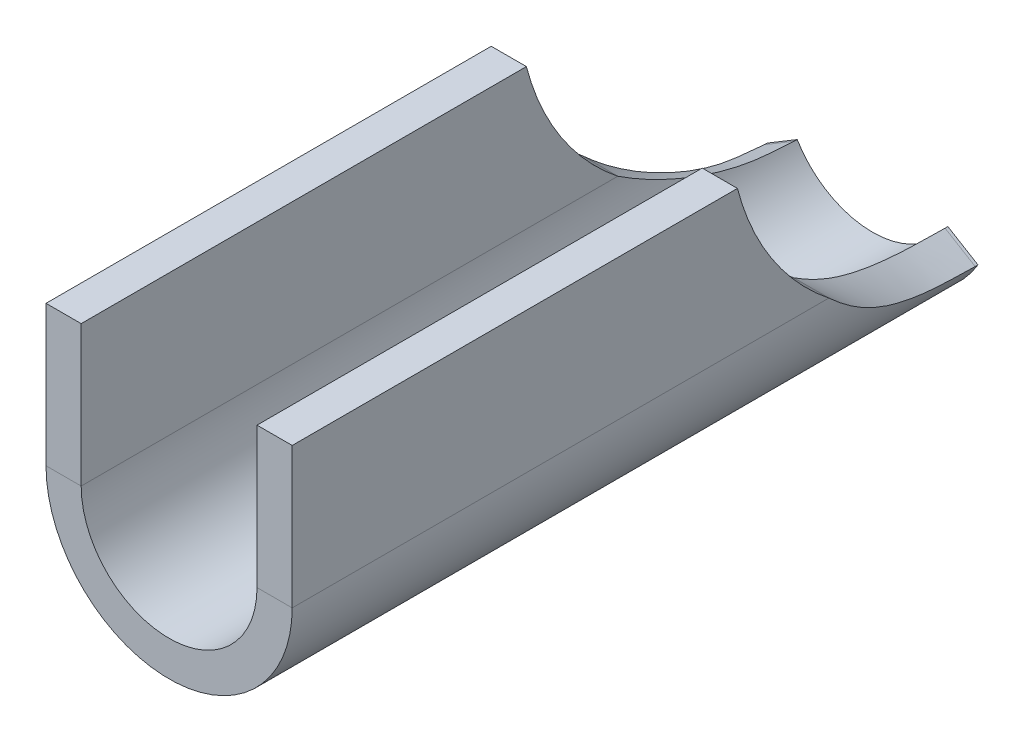
ISO-10303-21;
HEADER;
FILE_DESCRIPTION(('STEP AP214'),'2;1');
FILE_NAME('part.step','',(''),(''),'','','');
FILE_SCHEMA(('AUTOMOTIVE_DESIGN { 1 0 10303 214 1 1 1 1 }'));
ENDSEC;
DATA;
#1=APPLICATION_CONTEXT('core data for automotive mechanical design processes');
#2=APPLICATION_PROTOCOL_DEFINITION('international standard','automotive_design',2000,#1);
#3=PRODUCT_CONTEXT('',#1,'mechanical');
#4=PRODUCT('Part','Part','',(#3));
#5=PRODUCT_RELATED_PRODUCT_CATEGORY('part','',(#4));
#6=PRODUCT_DEFINITION_FORMATION('','',#4);
#7=PRODUCT_DEFINITION_CONTEXT('part definition',#1,'design');
#8=PRODUCT_DEFINITION('design','',#6,#7);
#9=PRODUCT_DEFINITION_SHAPE('','',#8);
#10=(LENGTH_UNIT() NAMED_UNIT(*) SI_UNIT(.MILLI.,.METRE.));
#11=(NAMED_UNIT(*) PLANE_ANGLE_UNIT() SI_UNIT($,.RADIAN.));
#12=(NAMED_UNIT(*) SI_UNIT($,.STERADIAN.) SOLID_ANGLE_UNIT());
#13=UNCERTAINTY_MEASURE_WITH_UNIT(LENGTH_MEASURE(1.E-05),#10,'distance_accuracy_value','');
#14=(GEOMETRIC_REPRESENTATION_CONTEXT(3) GLOBAL_UNCERTAINTY_ASSIGNED_CONTEXT((#13)) GLOBAL_UNIT_ASSIGNED_CONTEXT((#10,
#11,#12)) REPRESENTATION_CONTEXT('',''));
#15=CARTESIAN_POINT('',(0.,0.,0.));
#16=DIRECTION('',(0.,0.,1.));
#17=DIRECTION('',(1.,0.,0.));
#18=AXIS2_PLACEMENT_3D('',#15,#16,#17);
#19=CARTESIAN_POINT('',(-14.,1.04083408558608E-13,40.));
#20=DIRECTION('',(0.,1.,0.));
#21=DIRECTION('',(0.,0.,1.));
#22=AXIS2_PLACEMENT_3D('',#19,#20,#21);
#23=PLANE('',#22);
#24=DIRECTION('',(0.,0.,-1.));
#25=VECTOR('',#24,1.);
#26=CARTESIAN_POINT('',(-12.,1.04083408558608E-13,40.));
#27=LINE('',#26,#25);
#28=CARTESIAN_POINT('',(-12.,1.04083408558608E-13,40.));
#29=VERTEX_POINT('',#28);
#30=CARTESIAN_POINT('',(-12.,1.2490009027033E-13,14.6824583655185));
#31=VERTEX_POINT('',#30);
#32=EDGE_CURVE('E372',#29,#31,#27,.T.);
#33=ORIENTED_EDGE('',*,*,#32,.T.);
#34=DIRECTION('',(-1.,0.,0.));
#35=VECTOR('',#34,1.);
#36=CARTESIAN_POINT('',(-14.,1.2490009027033E-13,14.6824583655185));
#37=LINE('',#36,#35);
#38=CARTESIAN_POINT('',(-14.,1.2490009027033E-13,14.6824583655185));
#39=VERTEX_POINT('',#38);
#40=EDGE_CURVE('E360',#39,#31,#37,.F.);
#41=ORIENTED_EDGE('',*,*,#40,.F.);
#42=DIRECTION('',(0.,0.,-1.));
#43=VECTOR('',#42,1.);
#44=CARTESIAN_POINT('',(-14.,1.04083408558608E-13,40.));
#45=LINE('',#44,#43);
#46=CARTESIAN_POINT('',(-14.,1.04083408558608E-13,40.));
#47=VERTEX_POINT('',#46);
#48=EDGE_CURVE('E369',#47,#39,#45,.T.);
#49=ORIENTED_EDGE('',*,*,#48,.F.);
#50=DIRECTION('',(1.,0.,0.));
#51=VECTOR('',#50,1.);
#52=CARTESIAN_POINT('',(-14.,1.04083408558608E-13,40.));
#53=LINE('',#52,#51);
#54=EDGE_CURVE('E363',#47,#29,#53,.T.);
#55=ORIENTED_EDGE('',*,*,#54,.T.);
#56=EDGE_LOOP('',(#33,#41,#49,#55));
#57=FACE_BOUND('',#56,.T.);
#58=ADVANCED_FACE('F51',(#57),#23,.T.);
#59=CARTESIAN_POINT('',(-2.,-7.9999999999999,40.));
#60=DIRECTION('',(0.,0.,1.));
#61=DIRECTION('',(1.,0.,0.));
#62=AXIS2_PLACEMENT_3D('',#59,#60,#61);
#63=PLANE('',#62);
#64=DIRECTION('',(0.,1.,0.));
#65=VECTOR('',#64,1.);
#66=CARTESIAN_POINT('',(-14.,-7.9999999999999,40.));
#67=LINE('',#66,#65);
#68=CARTESIAN_POINT('',(-14.,-7.99999999999994,40.));
#69=VERTEX_POINT('',#68);
#70=EDGE_CURVE('E366',#69,#47,#67,.T.);
#71=ORIENTED_EDGE('',*,*,#70,.F.);
#72=DIRECTION('',(1.,0.,0.));
#73=VECTOR('',#72,1.);
#74=CARTESIAN_POINT('',(-14.,-7.9999999999999,40.));
#75=LINE('',#74,#73);
#76=CARTESIAN_POINT('',(-12.,-7.9999999999999,40.));
#77=VERTEX_POINT('',#76);
#78=EDGE_CURVE('E12',#69,#77,#75,.T.);
#79=ORIENTED_EDGE('',*,*,#78,.T.);
#80=DIRECTION('',(0.,1.,0.));
#81=VECTOR('',#80,1.);
#82=CARTESIAN_POINT('',(-12.,-7.9999999999999,40.));
#83=LINE('',#82,#81);
#84=EDGE_CURVE('E70',#77,#29,#83,.T.);
#85=ORIENTED_EDGE('',*,*,#84,.T.);
#86=ORIENTED_EDGE('',*,*,#54,.F.);
#87=EDGE_LOOP('',(#71,#79,#85,#86));
#88=FACE_BOUND('',#87,.T.);
#89=ADVANCED_FACE('F53',(#88),#63,.T.);
#90=CARTESIAN_POINT('',(-12.,-7.9999999999999,40.));
#91=DIRECTION('',(-1.,0.,0.));
#92=DIRECTION('',(0.,0.,1.));
#93=AXIS2_PLACEMENT_3D('',#90,#91,#92);
#94=PLANE('',#93);
#95=CARTESIAN_POINT('',(-12.,3.75000000000013,0.158770817240728));
#96=DIRECTION('',(-1.,0.,0.));
#97=DIRECTION('',(0.,-1.,0.));
#98=AXIS2_PLACEMENT_3D('',#95,#96,#97);
#99=CIRCLE('',#98,15.);
#100=CARTESIAN_POINT('',(-12.,-7.9999999999999,9.48279891672646));
#101=VERTEX_POINT('',#100);
#102=EDGE_CURVE('E77',#101,#31,#99,.T.);
#103=ORIENTED_EDGE('',*,*,#102,.T.);
#104=ORIENTED_EDGE('',*,*,#32,.F.);
#105=ORIENTED_EDGE('',*,*,#84,.F.);
#106=DIRECTION('',(0.,0.,-1.));
#107=VECTOR('',#106,1.);
#108=CARTESIAN_POINT('',(-12.,-7.9999999999999,40.));
#109=LINE('',#108,#107);
#110=EDGE_CURVE('E62',#77,#101,#109,.T.);
#111=ORIENTED_EDGE('',*,*,#110,.T.);
#112=EDGE_LOOP('',(#103,#104,#105,#111));
#113=FACE_BOUND('',#112,.T.);
#114=ADVANCED_FACE('F453',(#113),#94,.F.);
#115=CARTESIAN_POINT('',(-14.,-7.9999999999999,40.));
#116=DIRECTION('',(-1.,0.,0.));
#117=DIRECTION('',(0.,0.,1.));
#118=AXIS2_PLACEMENT_3D('',#115,#116,#117);
#119=PLANE('',#118);
#120=ORIENTED_EDGE('',*,*,#48,.T.);
#121=CARTESIAN_POINT('',(-14.,3.75000000000013,0.158770817240728));
#122=DIRECTION('',(-1.,0.,0.));
#123=DIRECTION('',(0.,-1.,0.));
#124=AXIS2_PLACEMENT_3D('',#121,#122,#123);
#125=CIRCLE('',#124,15.);
#126=CARTESIAN_POINT('',(-14.,-7.9999999999999,9.48279891672646));
#127=VERTEX_POINT('',#126);
#128=EDGE_CURVE('E376',#127,#39,#125,.T.);
#129=ORIENTED_EDGE('',*,*,#128,.F.);
#130=DIRECTION('',(0.,0.,-1.));
#131=VECTOR('',#130,1.);
#132=CARTESIAN_POINT('',(-14.,-7.9999999999999,40.));
#133=LINE('',#132,#131);
#134=EDGE_CURVE('E374',#69,#127,#133,.T.);
#135=ORIENTED_EDGE('',*,*,#134,.F.);
#136=ORIENTED_EDGE('',*,*,#70,.T.);
#137=EDGE_LOOP('',(#120,#129,#135,#136));
#138=FACE_BOUND('',#137,.T.);
#139=ADVANCED_FACE('F393',(#138),#119,.T.);
#140=CARTESIAN_POINT('',(-14.,3.75000000000013,0.158770817240728));
#141=DIRECTION('',(-1.,0.,0.));
#142=DIRECTION('',(0.,-1.,0.));
#143=AXIS2_PLACEMENT_3D('',#140,#141,#142);
#144=CYLINDRICAL_SURFACE('',#143,15.);
#145=ORIENTED_EDGE('',*,*,#128,.T.);
#146=ORIENTED_EDGE('',*,*,#40,.T.);
#147=ORIENTED_EDGE('',*,*,#102,.F.);
#148=CARTESIAN_POINT('',(-14.,-8.,9.48279891672646));
#149=CARTESIAN_POINT('',(-12.,-8.,9.48279891672646));
#150=B_SPLINE_CURVE_WITH_KNOTS('',1,(#148,#149),.UNSPECIFIED.,.F.,.F.,(2,2),(0.,1.),.UNSPECIFIED.);
#151=EDGE_CURVE('E381',#127,#101,#150,.T.);
#152=ORIENTED_EDGE('',*,*,#151,.F.);
#153=EDGE_LOOP('',(#145,#146,#147,#152));
#154=FACE_BOUND('',#153,.T.);
#155=ADVANCED_FACE('F323',(#154),#144,.F.);
#156=CARTESIAN_POINT('',(-2.,0.,40.));
#157=DIRECTION('',(0.,1.,0.));
#158=DIRECTION('',(0.,0.,1.));
#159=AXIS2_PLACEMENT_3D('',#156,#157,#158);
#160=PLANE('',#159);
#161=DIRECTION('',(0.,0.,-1.));
#162=VECTOR('',#161,1.);
#163=CARTESIAN_POINT('',(0.,0.,40.));
#164=LINE('',#163,#162);
#165=CARTESIAN_POINT('',(0.,0.,40.));
#166=VERTEX_POINT('',#165);
#167=CARTESIAN_POINT('',(0.,0.,14.6824583655185));
#168=VERTEX_POINT('',#167);
#169=EDGE_CURVE('E484',#166,#168,#164,.T.);
#170=ORIENTED_EDGE('',*,*,#169,.T.);
#171=DIRECTION('',(1.,0.,0.));
#172=VECTOR('',#171,1.);
#173=CARTESIAN_POINT('',(0.,0.,14.6824583655185));
#174=LINE('',#173,#172);
#175=CARTESIAN_POINT('',(-2.,0.,14.6824583655185));
#176=VERTEX_POINT('',#175);
#177=EDGE_CURVE('E481',#168,#176,#174,.F.);
#178=ORIENTED_EDGE('',*,*,#177,.T.);
#179=DIRECTION('',(0.,0.,-1.));
#180=VECTOR('',#179,1.);
#181=CARTESIAN_POINT('',(-2.,0.,40.));
#182=LINE('',#181,#180);
#183=CARTESIAN_POINT('',(-2.,0.,40.));
#184=VERTEX_POINT('',#183);
#185=EDGE_CURVE('E470',#184,#176,#182,.T.);
#186=ORIENTED_EDGE('',*,*,#185,.F.);
#187=DIRECTION('',(1.,0.,0.));
#188=VECTOR('',#187,1.);
#189=CARTESIAN_POINT('',(-2.,0.,40.));
#190=LINE('',#189,#188);
#191=EDGE_CURVE('E357',#184,#166,#190,.T.);
#192=ORIENTED_EDGE('',*,*,#191,.T.);
#193=EDGE_LOOP('',(#170,#178,#186,#192));
#194=FACE_BOUND('',#193,.T.);
#195=ADVANCED_FACE('F319',(#194),#160,.T.);
#196=CARTESIAN_POINT('',(0.,0.,40.));
#197=DIRECTION('',(1.,0.,0.));
#198=DIRECTION('',(0.,0.,-1.));
#199=AXIS2_PLACEMENT_3D('',#196,#197,#198);
#200=PLANE('',#199);
#201=DIRECTION('',(0.,0.,-1.));
#202=VECTOR('',#201,1.);
#203=CARTESIAN_POINT('',(0.,-8.,40.));
#204=LINE('',#203,#202);
#205=CARTESIAN_POINT('',(0.,-8.,40.));
#206=VERTEX_POINT('',#205);
#207=CARTESIAN_POINT('',(0.,-8.,9.48279891672649));
#208=VERTEX_POINT('',#207);
#209=EDGE_CURVE('E354',#206,#208,#204,.T.);
#210=ORIENTED_EDGE('',*,*,#209,.T.);
#211=CARTESIAN_POINT('',(0.,3.75,0.158770817240728));
#212=DIRECTION('',(1.,0.,0.));
#213=DIRECTION('',(0.,0.,-1.));
#214=AXIS2_PLACEMENT_3D('',#211,#212,#213);
#215=CIRCLE('',#214,15.);
#216=EDGE_CURVE('E342',#168,#208,#215,.T.);
#217=ORIENTED_EDGE('',*,*,#216,.F.);
#218=ORIENTED_EDGE('',*,*,#169,.F.);
#219=DIRECTION('',(0.,-1.,0.));
#220=VECTOR('',#219,1.);
#221=CARTESIAN_POINT('',(0.,0.,40.));
#222=LINE('',#221,#220);
#223=EDGE_CURVE('E351',#166,#206,#222,.T.);
#224=ORIENTED_EDGE('',*,*,#223,.T.);
#225=EDGE_LOOP('',(#210,#217,#218,#224));
#226=FACE_BOUND('',#225,.T.);
#227=ADVANCED_FACE('F322',(#226),#200,.T.);
#228=CARTESIAN_POINT('',(0.,3.75,0.158770817240728));
#229=DIRECTION('',(1.,0.,0.));
#230=DIRECTION('',(0.,0.,-1.));
#231=AXIS2_PLACEMENT_3D('',#228,#229,#230);
#232=CYLINDRICAL_SURFACE('',#231,15.);
#233=ORIENTED_EDGE('',*,*,#216,.T.);
#234=CARTESIAN_POINT('',(-2.,-8.,9.48279891672649));
#235=CARTESIAN_POINT('',(0.,-8.,9.48279891672649));
#236=B_SPLINE_CURVE_WITH_KNOTS('',1,(#234,#235),.UNSPECIFIED.,.F.,.F.,(2,2),(0.,1.),.UNSPECIFIED.);
#237=CARTESIAN_POINT('',(-2.,-8.,9.48279891672649));
#238=VERTEX_POINT('',#237);
#239=EDGE_CURVE('E350',#208,#238,#236,.F.);
#240=ORIENTED_EDGE('',*,*,#239,.T.);
#241=CARTESIAN_POINT('',(-2.,3.75,0.158770817240728));
#242=DIRECTION('',(1.,0.,0.));
#243=DIRECTION('',(0.,0.,-1.));
#244=AXIS2_PLACEMENT_3D('',#241,#242,#243);
#245=CIRCLE('',#244,15.);
#246=EDGE_CURVE('E475',#176,#238,#245,.T.);
#247=ORIENTED_EDGE('',*,*,#246,.F.);
#248=ORIENTED_EDGE('',*,*,#177,.F.);
#249=EDGE_LOOP('',(#233,#240,#247,#248));
#250=FACE_BOUND('',#249,.T.);
#251=ADVANCED_FACE('F327',(#250),#232,.F.);
#252=CARTESIAN_POINT('',(-2.,0.,40.));
#253=DIRECTION('',(1.,0.,0.));
#254=DIRECTION('',(0.,0.,-1.));
#255=AXIS2_PLACEMENT_3D('',#252,#253,#254);
#256=PLANE('',#255);
#257=ORIENTED_EDGE('',*,*,#246,.T.);
#258=DIRECTION('',(0.,0.,-1.));
#259=VECTOR('',#258,1.);
#260=CARTESIAN_POINT('',(-2.,-8.,40.));
#261=LINE('',#260,#259);
#262=CARTESIAN_POINT('',(-2.,-8.,40.));
#263=VERTEX_POINT('',#262);
#264=EDGE_CURVE('E153',#263,#238,#261,.T.);
#265=ORIENTED_EDGE('',*,*,#264,.F.);
#266=DIRECTION('',(0.,1.,0.));
#267=VECTOR('',#266,1.);
#268=CARTESIAN_POINT('',(-2.,0.,40.));
#269=LINE('',#268,#267);
#270=EDGE_CURVE('E469',#184,#263,#269,.F.);
#271=ORIENTED_EDGE('',*,*,#270,.F.);
#272=ORIENTED_EDGE('',*,*,#185,.T.);
#273=EDGE_LOOP('',(#257,#265,#271,#272));
#274=FACE_BOUND('',#273,.T.);
#275=ADVANCED_FACE('F332',(#274),#256,.F.);
#276=CARTESIAN_POINT('',(-7.,-8.,40.));
#277=DIRECTION('',(0.,0.,-1.));
#278=DIRECTION('',(-1.,0.,0.));
#279=AXIS2_PLACEMENT_3D('',#276,#277,#278);
#280=PLANE('',#279);
#281=ORIENTED_EDGE('',*,*,#270,.T.);
#282=DIRECTION('',(1.,0.,0.));
#283=VECTOR('',#282,1.);
#284=CARTESIAN_POINT('',(-2.,-8.,40.));
#285=LINE('',#284,#283);
#286=EDGE_CURVE('E309',#263,#206,#285,.T.);
#287=ORIENTED_EDGE('',*,*,#286,.T.);
#288=ORIENTED_EDGE('',*,*,#223,.F.);
#289=ORIENTED_EDGE('',*,*,#191,.F.);
#290=EDGE_LOOP('',(#281,#287,#288,#289));
#291=FACE_BOUND('',#290,.T.);
#292=ADVANCED_FACE('F446',(#291),#280,.F.);
#293=CARTESIAN_POINT('',(-7.,-8.,0.));
#294=DIRECTION('',(0.,0.,-1.));
#295=DIRECTION('',(-1.,0.,0.));
#296=AXIS2_PLACEMENT_3D('',#293,#294,#295);
#297=PLANE('',#296);
#298=DIRECTION('',(-0.85685059717934,-0.515564791382624,0.));
#299=VECTOR('',#298,1.);
#300=CARTESIAN_POINT('',(-12.9979541802554,-11.6089535396784,0.));
#301=LINE('',#300,#299);
#302=CARTESIAN_POINT('',(-11.2842529858967,-10.5778239569131,0.));
#303=VERTEX_POINT('',#302);
#304=CARTESIAN_POINT('',(-12.9979541802554,-11.6089535396784,0.));
#305=VERTEX_POINT('',#304);
#306=EDGE_CURVE('E143',#303,#305,#301,.T.);
#307=ORIENTED_EDGE('',*,*,#306,.F.);
#308=CARTESIAN_POINT('',(-7.,-8.,0.));
#309=DIRECTION('',(0.,0.,-1.));
#310=DIRECTION('',(-1.,0.,0.));
#311=AXIS2_PLACEMENT_3D('',#308,#309,#310);
#312=CIRCLE('',#311,5.);
#313=CARTESIAN_POINT('',(-2.71574701410335,-10.5778239569132,0.));
#314=VERTEX_POINT('',#313);
#315=EDGE_CURVE('E224',#303,#314,#312,.F.);
#316=ORIENTED_EDGE('',*,*,#315,.T.);
#317=DIRECTION('',(0.85685059717933,-0.51556479138264,0.));
#318=VECTOR('',#317,1.);
#319=CARTESIAN_POINT('',(-1.00204581974469,-11.6089535396785,0.));
#320=LINE('',#319,#318);
#321=CARTESIAN_POINT('',(-1.00204581974469,-11.6089535396785,0.));
#322=VERTEX_POINT('',#321);
#323=EDGE_CURVE('E154',#314,#322,#320,.T.);
#324=ORIENTED_EDGE('',*,*,#323,.T.);
#325=CARTESIAN_POINT('',(-7.,-8.,0.));
#326=DIRECTION('',(0.,0.,1.));
#327=DIRECTION('',(1.,0.,0.));
#328=AXIS2_PLACEMENT_3D('',#325,#326,#327);
#329=CIRCLE('',#328,7.);
#330=EDGE_CURVE('E157',#305,#322,#329,.T.);
#331=ORIENTED_EDGE('',*,*,#330,.F.);
#332=EDGE_LOOP('',(#307,#316,#324,#331));
#333=FACE_BOUND('',#332,.T.);
#334=ADVANCED_FACE('F158',(#333),#297,.T.);
#335=CARTESIAN_POINT('',(-1.00204581974469,-11.6089535396785,0.079385408620361));
#336=DIRECTION('',(0.51556479138264,0.85685059717933,0.));
#337=DIRECTION('',(0.,0.,1.));
#338=AXIS2_PLACEMENT_3D('',#335,#336,#337);
#339=PLANE('',#338);
#340=ORIENTED_EDGE('',*,*,#323,.F.);
#341=DIRECTION('',(0.,0.,-1.));
#342=VECTOR('',#341,1.);
#343=CARTESIAN_POINT('',(-2.71574701410335,-10.5778239569132,69.005445347089));
#344=LINE('',#343,#342);
#345=CARTESIAN_POINT('',(-2.71574701410335,-10.5778239569132,0.158770817240722));
#346=VERTEX_POINT('',#345);
#347=EDGE_CURVE('E215',#314,#346,#344,.F.);
#348=ORIENTED_EDGE('',*,*,#347,.T.);
#349=CARTESIAN_POINT('',(-1.00204581974469,-11.6089535396785,0.158770817240722));
#350=CARTESIAN_POINT('',(-2.71574701410335,-10.5778239569132,0.158770817240722));
#351=B_SPLINE_CURVE_WITH_KNOTS('',1,(#349,#350),.UNSPECIFIED.,.F.,.F.,(2,2),(0.,1.),.UNSPECIFIED.);
#352=CARTESIAN_POINT('',(-1.00204581974469,-11.6089535396785,0.158770817240722));
#353=VERTEX_POINT('',#352);
#354=EDGE_CURVE('E172',#346,#353,#351,.F.);
#355=ORIENTED_EDGE('',*,*,#354,.T.);
#356=DIRECTION('',(0.,0.,1.));
#357=VECTOR('',#356,1.);
#358=CARTESIAN_POINT('',(-1.00204581974469,-11.6089535396785,0.));
#359=LINE('',#358,#357);
#360=EDGE_CURVE('E162',#322,#353,#359,.T.);
#361=ORIENTED_EDGE('',*,*,#360,.F.);
#362=EDGE_LOOP('',(#340,#348,#355,#361));
#363=FACE_BOUND('',#362,.T.);
#364=ADVANCED_FACE('F249',(#363),#339,.T.);
#365=CARTESIAN_POINT('',(-1.00204581974469,-11.6089535396785,0.158770817240722));
#366=CARTESIAN_POINT('',(-0.985708337920428,-11.5818012180081,0.730464719622924));
#367=CARTESIAN_POINT('',(-0.96676653701687,-11.5499153382788,1.22956995000527));
#368=CARTESIAN_POINT('',(-0.934783317569084,-11.4947958205185,1.86934471989861));
#369=CARTESIAN_POINT('',(-0.923528224729409,-11.4752070363556,2.0644558010097));
#370=CARTESIAN_POINT('',(-0.905806344146855,-11.4439725580002,2.32990165939635));
#371=CARTESIAN_POINT('',(-0.899759246124836,-11.4332524884662,2.41384681831189));
#372=CARTESIAN_POINT('',(-0.890485994030063,-11.4167058092638,2.53295936586521));
#373=CARTESIAN_POINT('',(-0.88736114688623,-11.4111124855619,2.57152934991297));
#374=CARTESIAN_POINT('',(-0.882624159009066,-11.4026053774275,2.62768302827962));
#375=CARTESIAN_POINT('',(-0.88103687713397,-11.3997501541986,2.64611737145101));
#376=CARTESIAN_POINT('',(-0.878643643890197,-11.3954379782299,2.67334356178184));
#377=CARTESIAN_POINT('',(-0.877843847754514,-11.3939956960475,2.68234807115441));
#378=CARTESIAN_POINT('',(-0.876641090931798,-11.3918249298942,2.6957485041067));
#379=CARTESIAN_POINT('',(-0.876239661555454,-11.3911001173628,2.7001975932397));
#380=CARTESIAN_POINT('',(-0.875435784438738,-11.3896480434037,2.70906032780352));
#381=CARTESIAN_POINT('',(-0.875200673157735,-11.389223302487,2.71164846647976));
#382=CARTESIAN_POINT('',(-0.838131685100897,-11.3222078460287,3.11604143820889));
#383=CARTESIAN_POINT('',(-0.790386497966529,-11.2336531179235,3.5200978029581));
#384=CARTESIAN_POINT('',(-0.706286017442382,-11.0648193076725,4.13500958511348));
#385=CARTESIAN_POINT('',(-0.676196325035098,-11.0025324485708,4.34145138500387));
#386=CARTESIAN_POINT('',(-0.628753969588697,-10.8997668054558,4.65332089359734));
#387=CARTESIAN_POINT('',(-0.612556853075023,-10.8639554581353,4.75764519792146));
#388=CARTESIAN_POINT('',(-0.587798799773172,-10.8078627945744,4.91468335659714));
#389=CARTESIAN_POINT('',(-0.579469158527705,-10.7887692965838,4.96712135985396));
#390=CARTESIAN_POINT('',(-0.566874242143346,-10.7595299604403,5.04591629028653));
#391=CARTESIAN_POINT('',(-0.562659201020727,-10.7496836670942,5.07220425468862));
#392=CARTESIAN_POINT('',(-0.556313469537473,-10.7347638115489,5.11167068267859));
#393=CARTESIAN_POINT('',(-0.554194364502354,-10.7297654571408,5.12483190557304));
#394=CARTESIAN_POINT('',(-0.5499487594211,-10.7197185029924,5.15116584515758));
#395=CARTESIAN_POINT('',(-0.547651023298518,-10.7142620157704,5.1653979958134));
#396=CARTESIAN_POINT('',(-0.420329279300062,-10.4109792816483,5.95313492125406));
#397=CARTESIAN_POINT('',(-0.287398999484325,-10.0386312734864,6.69971736010421));
#398=CARTESIAN_POINT('',(-0.0771392811164387,-9.13535418627835,8.13481132386785));
#399=CARTESIAN_POINT('',(0.,-8.6038590688786,8.8229980608924));
#400=CARTESIAN_POINT('',(0.,-8.,9.48279891672649));
#401=CARTESIAN_POINT('',(-2.71574701410335,-10.5778239569132,0.158770817240722));
#402=CARTESIAN_POINT('',(-2.70407738407874,-10.5584294411849,0.730464726977965));
#403=CARTESIAN_POINT('',(-2.69054752644062,-10.5356538130563,1.22956995000527));
#404=CARTESIAN_POINT('',(-2.6677023696922,-10.4962827289418,1.86934471989861));
#405=CARTESIAN_POINT('',(-2.65966301766386,-10.482290740254,2.0644558010097));
#406=CARTESIAN_POINT('',(-2.64700453153347,-10.4599803985715,2.32990165939635));
#407=CARTESIAN_POINT('',(-2.64268517580345,-10.4523232060473,2.41384681831189));
#408=CARTESIAN_POINT('',(-2.63606142430719,-10.4405041494741,2.53295936586521));
#409=CARTESIAN_POINT('',(-2.63382939063302,-10.4365089182585,2.57152934991297));
#410=CARTESIAN_POINT('',(-2.63044582786362,-10.4304324124482,2.62768302827962));
#411=CARTESIAN_POINT('',(-2.62931205509569,-10.4283929672847,2.64611737145101));
#412=CARTESIAN_POINT('',(-2.62760260277871,-10.4253128415928,2.67334356178184));
#413=CARTESIAN_POINT('',(-2.62703131982465,-10.424282640034,2.68234807115441));
#414=CARTESIAN_POINT('',(-2.62617220780843,-10.4227320927816,2.6957485041067));
#415=CARTESIAN_POINT('',(-2.62588547253961,-10.4222143695448,2.7001975932397));
#416=CARTESIAN_POINT('',(-2.6253112745991,-10.4211771738598,2.70906032780352));
#417=CARTESIAN_POINT('',(-2.62514333796981,-10.4208737874907,2.71164846647976));
#418=CARTESIAN_POINT('',(-2.59866548935778,-10.3730056043062,3.11604143820889));
#419=CARTESIAN_POINT('',(-2.56456178426181,-10.3097522270882,3.5200978029581));
#420=CARTESIAN_POINT('',(-2.50449001245884,-10.1891566483375,4.13500958511348));
#421=CARTESIAN_POINT('',(-2.48299737502507,-10.1446660346934,4.34145138500387));
#422=CARTESIAN_POINT('',(-2.44910997827764,-10.071262003897,4.65332089359734));
#423=CARTESIAN_POINT('',(-2.4375406093393,-10.0456824700966,4.75764519792146));
#424=CARTESIAN_POINT('',(-2.41985628555227,-10.0056162818388,4.91468335659714));
#425=CARTESIAN_POINT('',(-2.4139065418055,-9.9919780689884,4.96712135985396));
#426=CARTESIAN_POINT('',(-2.40491017295953,-9.97109282888592,5.04591629028653));
#427=CARTESIAN_POINT('',(-2.40189942930052,-9.96405976221015,5.07220425468862));
#428=CARTESIAN_POINT('',(-2.39736676395534,-9.95340272253496,5.11167068267859));
#429=CARTESIAN_POINT('',(-2.39585311750168,-9.94983246938631,5.12483190557304));
#430=CARTESIAN_POINT('',(-2.39282054244364,-9.94265607356598,5.15116584515758));
#431=CARTESIAN_POINT('',(-2.39117930235608,-9.93875858269317,5.1653979958134));
#432=CARTESIAN_POINT('',(-2.30023519950004,-9.72212805832024,5.95313492125406));
#433=CARTESIAN_POINT('',(-2.20528499963166,-9.45616519534742,6.69971736010421));
#434=CARTESIAN_POINT('',(-2.05509948651174,-8.81096727591311,8.13481132386785));
#435=CARTESIAN_POINT('',(-2.,-8.43125504829953,8.82310951159608));
#436=CARTESIAN_POINT('',(-2.,-8.,9.48279891672649));
#437=B_SPLINE_SURFACE_WITH_KNOTS('',1,3,((#365,#366,#367,#368,#369,#370,#371,#372,#373,#374,
#375,#376,#377,#378,#379,#380,#381,#382,#383,#384,#385,#386,#387,#388,#389,#390,#391,#392,#393,
#394,#395,#396,#397,#398,#399,#400),(#401,#402,#403,#404,#405,#406,#407,#408,#409,#410,#411,
#412,#413,#414,#415,#416,#417,#418,#419,#420,#421,#422,#423,#424,#425,#426,#427,#428,#429,#430,
#431,#432,#433,#434,#435,#436)),.UNSPECIFIED.,.F.,.F.,.F.,(2,2),(4,2,2,2,2,2,2,2,2,2,2,2,2,2,2,
2,2,4),(0.,1.),(0.,0.125,0.1875,0.21875,0.234375,0.2421875,0.24609375,0.248046875,0.25,0.375,
0.4375,0.46875,0.484375,0.4921875,0.49609375,0.5,0.75,1.),.UNSPECIFIED.);
#438=CARTESIAN_POINT('',(-2.71574701410335,-10.5778239569132,0.158770817240722));
#439=CARTESIAN_POINT('',(-2.70407738407874,-10.5584294411849,0.730464726977965));
#440=CARTESIAN_POINT('',(-2.69054752644062,-10.5356538130563,1.22956995000527));
#441=CARTESIAN_POINT('',(-2.6677023696922,-10.4962827289418,1.86934471989861));
#442=CARTESIAN_POINT('',(-2.65966301766386,-10.482290740254,2.0644558010097));
#443=CARTESIAN_POINT('',(-2.64700453153347,-10.4599803985715,2.32990165939635));
#444=CARTESIAN_POINT('',(-2.64268517580345,-10.4523232060473,2.41384681831189));
#445=CARTESIAN_POINT('',(-2.63606142430719,-10.4405041494741,2.53295936586521));
#446=CARTESIAN_POINT('',(-2.63382939063302,-10.4365089182585,2.57152934991297));
#447=CARTESIAN_POINT('',(-2.63044582786362,-10.4304324124482,2.62768302827962));
#448=CARTESIAN_POINT('',(-2.62931205509569,-10.4283929672847,2.64611737145101));
#449=CARTESIAN_POINT('',(-2.62760260277871,-10.4253128415928,2.67334356178184));
#450=CARTESIAN_POINT('',(-2.62703131982465,-10.424282640034,2.68234807115441));
#451=CARTESIAN_POINT('',(-2.62617220780843,-10.4227320927816,2.6957485041067));
#452=CARTESIAN_POINT('',(-2.62588547253961,-10.4222143695448,2.7001975932397));
#453=CARTESIAN_POINT('',(-2.6253112745991,-10.4211771738598,2.70906032780352));
#454=CARTESIAN_POINT('',(-2.62514333796981,-10.4208737874907,2.71164846647976));
#455=CARTESIAN_POINT('',(-2.59866548935778,-10.3730056043062,3.11604143820889));
#456=CARTESIAN_POINT('',(-2.56456178426181,-10.3097522270882,3.5200978029581));
#457=CARTESIAN_POINT('',(-2.50449001245884,-10.1891566483375,4.13500958511348));
#458=CARTESIAN_POINT('',(-2.48299737502507,-10.1446660346934,4.34145138500387));
#459=CARTESIAN_POINT('',(-2.44910997827764,-10.071262003897,4.65332089359734));
#460=CARTESIAN_POINT('',(-2.4375406093393,-10.0456824700966,4.75764519792146));
#461=CARTESIAN_POINT('',(-2.41985628555227,-10.0056162818388,4.91468335659714));
#462=CARTESIAN_POINT('',(-2.4139065418055,-9.9919780689884,4.96712135985396));
#463=CARTESIAN_POINT('',(-2.40491017295953,-9.97109282888592,5.04591629028653));
#464=CARTESIAN_POINT('',(-2.40189942930052,-9.96405976221015,5.07220425468862));
#465=CARTESIAN_POINT('',(-2.39736676395534,-9.95340272253496,5.11167068267859));
#466=CARTESIAN_POINT('',(-2.39585311750168,-9.94983246938631,5.12483190557304));
#467=CARTESIAN_POINT('',(-2.39282054244364,-9.94265607356598,5.15116584515758));
#468=CARTESIAN_POINT('',(-2.39117930235608,-9.93875858269317,5.1653979958134));
#469=CARTESIAN_POINT('',(-2.30023519950004,-9.72212805832024,5.95313492125406));
#470=CARTESIAN_POINT('',(-2.20528499963166,-9.45616519534742,6.69971736010421));
#471=CARTESIAN_POINT('',(-2.05509948651174,-8.81096727591311,8.13481132386785));
#472=CARTESIAN_POINT('',(-2.,-8.43125504829953,8.82310951159608));
#473=CARTESIAN_POINT('',(-2.,-8.,9.48279891672649));
#474=B_SPLINE_CURVE_WITH_KNOTS('',3,(#438,#439,#440,#441,#442,#443,#444,#445,#446,#447,#448,
#449,#450,#451,#452,#453,#454,#455,#456,#457,#458,#459,#460,#461,#462,#463,#464,#465,#466,#467,
#468,#469,#470,#471,#472,#473),.UNSPECIFIED.,.F.,.F.,(4,2,2,2,2,2,2,2,2,2,2,2,2,2,2,2,2,4),(0.,
0.125,0.1875,0.21875,0.234375,0.2421875,0.24609375,0.248046875,0.25,0.375,0.4375,0.46875,
0.484375,0.4921875,0.49609375,0.5,0.75,1.),.UNSPECIFIED.);
#475=EDGE_CURVE('E223',#346,#238,#474,.T.);
#476=CARTESIAN_POINT('',(0.,-8.,9.48279891672649));
#477=CARTESIAN_POINT('',(0.,-8.6038590688786,8.8229980608924));
#478=CARTESIAN_POINT('',(-0.0771392811164387,-9.13535418627835,8.13481132386785));
#479=CARTESIAN_POINT('',(-0.287398999484325,-10.0386312734864,6.69971736010421));
#480=CARTESIAN_POINT('',(-0.420329279300062,-10.4109792816483,5.95313492125406));
#481=CARTESIAN_POINT('',(-0.547651023298518,-10.7142620157704,5.1653979958134));
#482=CARTESIAN_POINT('',(-0.5499487594211,-10.7197185029924,5.15116584515758));
#483=CARTESIAN_POINT('',(-0.554194364502354,-10.7297654571408,5.12483190557304));
#484=CARTESIAN_POINT('',(-0.556313469537473,-10.7347638115489,5.11167068267859));
#485=CARTESIAN_POINT('',(-0.562659201020727,-10.7496836670942,5.07220425468862));
#486=CARTESIAN_POINT('',(-0.566874242143346,-10.7595299604403,5.04591629028653));
#487=CARTESIAN_POINT('',(-0.579469158527705,-10.7887692965838,4.96712135985396));
#488=CARTESIAN_POINT('',(-0.587798799773172,-10.8078627945744,4.91468335659714));
#489=CARTESIAN_POINT('',(-0.612556853075023,-10.8639554581353,4.75764519792146));
#490=CARTESIAN_POINT('',(-0.628753969588697,-10.8997668054558,4.65332089359734));
#491=CARTESIAN_POINT('',(-0.676196325035098,-11.0025324485708,4.34145138500387));
#492=CARTESIAN_POINT('',(-0.706286017442382,-11.0648193076725,4.13500958511348));
#493=CARTESIAN_POINT('',(-0.790386497966529,-11.2336531179235,3.5200978029581));
#494=CARTESIAN_POINT('',(-0.838131685100897,-11.3222078460287,3.11604143820889));
#495=CARTESIAN_POINT('',(-0.875200673157735,-11.389223302487,2.71164846647976));
#496=CARTESIAN_POINT('',(-0.875435784438738,-11.3896480434037,2.70906032780352));
#497=CARTESIAN_POINT('',(-0.876239661555454,-11.3911001173628,2.7001975932397));
#498=CARTESIAN_POINT('',(-0.876641090931798,-11.3918249298942,2.6957485041067));
#499=CARTESIAN_POINT('',(-0.877843847754514,-11.3939956960475,2.68234807115441));
#500=CARTESIAN_POINT('',(-0.878643643890197,-11.3954379782299,2.67334356178184));
#501=CARTESIAN_POINT('',(-0.88103687713397,-11.3997501541986,2.64611737145101));
#502=CARTESIAN_POINT('',(-0.882624159009066,-11.4026053774275,2.62768302827962));
#503=CARTESIAN_POINT('',(-0.88736114688623,-11.4111124855619,2.57152934991297));
#504=CARTESIAN_POINT('',(-0.890485994030063,-11.4167058092638,2.53295936586521));
#505=CARTESIAN_POINT('',(-0.899759246124836,-11.4332524884662,2.41384681831189));
#506=CARTESIAN_POINT('',(-0.905806344146855,-11.4439725580002,2.32990165939635));
#507=CARTESIAN_POINT('',(-0.923528224729409,-11.4752070363556,2.0644558010097));
#508=CARTESIAN_POINT('',(-0.934783317569084,-11.4947958205185,1.86934471989861));
#509=CARTESIAN_POINT('',(-0.96676653701687,-11.5499153382788,1.22956995000527));
#510=CARTESIAN_POINT('',(-0.985708337920428,-11.5818012180081,0.730464719622924));
#511=CARTESIAN_POINT('',(-1.00204581974469,-11.6089535396785,0.158770817240722));
#512=B_SPLINE_CURVE_WITH_KNOTS('',3,(#476,#477,#478,#479,#480,#481,#482,#483,#484,#485,#486,
#487,#488,#489,#490,#491,#492,#493,#494,#495,#496,#497,#498,#499,#500,#501,#502,#503,#504,#505,
#506,#507,#508,#509,#510,#511),.UNSPECIFIED.,.F.,.F.,(4,2,2,2,2,2,2,2,2,2,2,2,2,2,2,2,2,4),(0.,
0.25,0.5,0.50390625,0.5078125,0.515625,0.53125,0.5625,0.625,0.75,0.751953125,0.75390625,
0.7578125,0.765625,0.78125,0.8125,0.875,1.),.UNSPECIFIED.);
#513=EDGE_CURVE('E231',#353,#208,#512,.F.);
#514=ORIENTED_EDGE('',*,*,#354,.F.);
#515=ORIENTED_EDGE('',*,*,#475,.T.);
#516=ORIENTED_EDGE('',*,*,#239,.F.);
#517=ORIENTED_EDGE('',*,*,#513,.F.);
#518=EDGE_LOOP('',(#514,#515,#516,#517));
#519=FACE_BOUND('',#518,.T.);
#520=ADVANCED_FACE('F237',(#519),#437,.T.);
#521=CARTESIAN_POINT('',(-7.,-8.,40.));
#522=DIRECTION('',(0.,0.,1.));
#523=DIRECTION('',(1.,0.,0.));
#524=AXIS2_PLACEMENT_3D('',#521,#522,#523);
#525=PLANE('',#524);
#526=ORIENTED_EDGE('',*,*,#286,.F.);
#527=CARTESIAN_POINT('',(-7.,-8.,40.));
#528=DIRECTION('',(0.,0.,-1.));
#529=DIRECTION('',(-1.,0.,0.));
#530=AXIS2_PLACEMENT_3D('',#527,#528,#529);
#531=CIRCLE('',#530,5.);
#532=EDGE_CURVE('E433',#263,#77,#531,.T.);
#533=ORIENTED_EDGE('',*,*,#532,.T.);
#534=ORIENTED_EDGE('',*,*,#78,.F.);
#535=CARTESIAN_POINT('',(-7.,-8.,40.));
#536=DIRECTION('',(0.,0.,-1.));
#537=DIRECTION('',(-1.,0.,0.));
#538=AXIS2_PLACEMENT_3D('',#535,#536,#537);
#539=CIRCLE('',#538,7.);
#540=EDGE_CURVE('E174',#206,#69,#539,.T.);
#541=ORIENTED_EDGE('',*,*,#540,.F.);
#542=EDGE_LOOP('',(#526,#533,#534,#541));
#543=FACE_BOUND('',#542,.T.);
#544=ADVANCED_FACE('F248',(#543),#525,.T.);
#545=CARTESIAN_POINT('',(-14.,-8.,9.48279891672646));
#546=CARTESIAN_POINT('',(-14.,-8.60385906887387,8.82299806089753));
#547=CARTESIAN_POINT('',(-13.9228607188847,-9.13535418627133,8.13481132387555));
#548=CARTESIAN_POINT('',(-13.7651659301095,-9.8128120016775,7.05849085105282));
#549=CARTESIAN_POINT('',(-13.7054207125888,-10.0189354629789,6.69245849586919));
#550=CARTESIAN_POINT('',(-13.6123544930597,-10.2992302825588,6.13252166672965));
#551=CARTESIAN_POINT('',(-13.5807433470151,-10.3878576731006,5.94406134095578));
#552=CARTESIAN_POINT('',(-13.5332286273556,-10.5137492952298,5.65864877820397));
#553=CARTESIAN_POINT('',(-13.5173731519157,-10.5545386606538,5.56305757827152));
#554=CARTESIAN_POINT('',(-13.4936542206526,-10.6139835510427,5.4189902598501));
#555=CARTESIAN_POINT('',(-13.4857585681691,-10.6335086723634,5.3708544006225));
#556=CARTESIAN_POINT('',(-13.4739418443385,-10.6623645560143,5.29848048215041));
#557=CARTESIAN_POINT('',(-13.470007392093,-10.6719112183789,5.27432748772126));
#558=CARTESIAN_POINT('',(-13.4641137122995,-10.6861236415364,5.23805546366988));
#559=CARTESIAN_POINT('',(-13.4621504852496,-10.6908431875715,5.22595770025148));
#560=CARTESIAN_POINT('',(-13.4582269135121,-10.7002464864709,5.20174799594544));
#561=CARTESIAN_POINT('',(-13.4564378049007,-10.7045223518555,5.19069548902308));
#562=CARTESIAN_POINT('',(-13.3861467443584,-10.8719569498756,4.75580619063463));
#563=CARTESIAN_POINT('',(-13.3217474760679,-11.0085413709174,4.33998017918237));
#564=CARTESIAN_POINT('',(-13.2376469955439,-11.1773751811685,3.72506839702699));
#565=CARTESIAN_POINT('',(-13.2116693686891,-11.227645050312,3.52156900881237));
#566=CARTESIAN_POINT('',(-13.176408971742,-11.2943291339761,3.21852673524619));
#567=CARTESIAN_POINT('',(-13.1652716049971,-11.3151033079956,3.11788044551674));
#568=CARTESIAN_POINT('',(-13.1495536037286,-11.3441159446684,2.96746271311152));
#569=CARTESIAN_POINT('',(-13.1444788499802,-11.3534286863414,2.91741541934127));
#570=CARTESIAN_POINT('',(-13.1371207321635,-11.3668642966277,2.84248240423313));
#571=CARTESIAN_POINT('',(-13.1347103558712,-11.3712539140645,2.81752772012163));
#572=CARTESIAN_POINT('',(-13.1311591266112,-11.3777054030887,2.78013017534117));
#573=CARTESIAN_POINT('',(-13.1299861056935,-11.3798337430924,2.76767007397882));
#574=CARTESIAN_POINT('',(-13.1282427594197,-11.3829930724663,2.748988542282));
#575=CARTESIAN_POINT('',(-13.1276643414898,-11.3840406521428,2.74276280177417));
#576=CARTESIAN_POINT('',(-13.1265129173251,-11.3861247601307,2.73031419420742));
#577=CARTESIAN_POINT('',(-13.1257725746309,-11.387463808953,2.72226582039366));
#578=CARTESIAN_POINT('',(-13.0737912939001,-11.4814385689361,2.15519167862265));
#579=CARTESIAN_POINT('',(-13.0306291353598,-11.5546489105377,1.30215832302292));
#580=CARTESIAN_POINT('',(-12.9979541802554,-11.6089535396784,0.158770817240722));
#581=CARTESIAN_POINT('',(-12.,-8.,9.48279891672646));
#582=CARTESIAN_POINT('',(-12.,-8.43125504829615,8.82310951160122));
#583=CARTESIAN_POINT('',(-11.9449005134891,-8.81096727590809,8.13481132387555));
#584=CARTESIAN_POINT('',(-11.8322613786496,-9.29486571548392,7.05849085105282));
#585=CARTESIAN_POINT('',(-11.7895862232777,-9.44209675927066,6.69245849586919));
#586=CARTESIAN_POINT('',(-11.7231103521855,-9.64230734468487,6.13252166672965));
#587=CARTESIAN_POINT('',(-11.7005309621537,-9.70561262364331,5.94406134095578));
#588=CARTESIAN_POINT('',(-11.6665918766826,-9.79553521087842,5.65864877820397));
#589=CARTESIAN_POINT('',(-11.6552665370826,-9.82467047189556,5.56305757827152));
#590=CARTESIAN_POINT('',(-11.6383244433233,-9.86713110788762,5.4189902598501));
#591=CARTESIAN_POINT('',(-11.6326846915494,-9.88107762311669,5.3708544006225));
#592=CARTESIAN_POINT('',(-11.6242441745275,-9.90168896858163,5.29848048215041));
#593=CARTESIAN_POINT('',(-11.621433851495,-9.90850801312781,5.27432748772126));
#594=CARTESIAN_POINT('',(-11.6172240802139,-9.91865974395456,5.23805546366988));
#595=CARTESIAN_POINT('',(-11.6158217751783,-9.92203084826539,5.22595770025148));
#596=CARTESIAN_POINT('',(-11.6130192239373,-9.92874749033639,5.20174799594544));
#597=CARTESIAN_POINT('',(-11.6117412892148,-9.93180167989678,5.19069548902308));
#598=CARTESIAN_POINT('',(-11.5615333888275,-10.0513978213397,4.75580619063463));
#599=CARTESIAN_POINT('',(-11.5155339114771,-10.1489581220839,4.33998017918237));
#600=CARTESIAN_POINT('',(-11.4554621396742,-10.2695537008346,3.72506839702699));
#601=CARTESIAN_POINT('',(-11.4369066919208,-10.3054607502229,3.52156900881237));
#602=CARTESIAN_POINT('',(-11.4117206941014,-10.3530922385544,3.21852673524619));
#603=CARTESIAN_POINT('',(-11.4037654321408,-10.3679309342825,3.11788044551674));
#604=CARTESIAN_POINT('',(-11.3925382883776,-10.3886542461917,2.96746271311152));
#605=CARTESIAN_POINT('',(-11.3889134642716,-10.3953062045296,2.91741541934127));
#606=CARTESIAN_POINT('',(-11.3836576658311,-10.4049030690198,2.84248240423313));
#607=CARTESIAN_POINT('',(-11.3819359684795,-10.408038510046,2.81752772012163));
#608=CARTESIAN_POINT('',(-11.3793993761509,-10.4126467164919,2.78013017534117));
#609=CARTESIAN_POINT('',(-11.3785615040668,-10.4141669593517,2.76767007397882));
#610=CARTESIAN_POINT('',(-11.3773162567284,-10.4164236231902,2.748988542282));
#611=CARTESIAN_POINT('',(-11.3769031010641,-10.4171718943877,2.74276280177417));
#612=CARTESIAN_POINT('',(-11.3760806552322,-10.4186605429505,2.73031419420742));
#613=CARTESIAN_POINT('',(-11.375551839022,-10.419617006395,2.72226582039366));
#614=CARTESIAN_POINT('',(-11.3384223527858,-10.4867418349544,2.15519167862265));
#615=CARTESIAN_POINT('',(-11.3075922428276,-10.539034930639,1.30215848395039));
#616=CARTESIAN_POINT('',(-11.2842529858967,-10.5778239569131,0.158770817240722));
#617=B_SPLINE_SURFACE_WITH_KNOTS('',1,3,((#545,#546,#547,#548,#549,#550,#551,#552,#553,#554,
#555,#556,#557,#558,#559,#560,#561,#562,#563,#564,#565,#566,#567,#568,#569,#570,#571,#572,#573,
#574,#575,#576,#577,#578,#579,#580),(#581,#582,#583,#584,#585,#586,#587,#588,#589,#590,#591,
#592,#593,#594,#595,#596,#597,#598,#599,#600,#601,#602,#603,#604,#605,#606,#607,#608,#609,#610,
#611,#612,#613,#614,#615,#616)),.UNSPECIFIED.,.F.,.F.,.F.,(2,2),(4,2,2,2,2,2,2,2,2,2,2,2,2,2,2,
2,2,4),(0.,1.),(0.,0.25,0.375,0.4375,0.46875,0.484375,0.4921875,0.49609375,0.5,0.625,0.6875,
0.71875,0.734375,0.7421875,0.74609375,0.748046875,0.75,1.),.UNSPECIFIED.);
#618=CARTESIAN_POINT('',(-12.,-8.,9.48279891672646));
#619=CARTESIAN_POINT('',(-12.,-8.43125504829615,8.82310951160122));
#620=CARTESIAN_POINT('',(-11.9449005134891,-8.81096727590809,8.13481132387555));
#621=CARTESIAN_POINT('',(-11.8322613786496,-9.29486571548392,7.05849085105282));
#622=CARTESIAN_POINT('',(-11.7895862232777,-9.44209675927066,6.69245849586919));
#623=CARTESIAN_POINT('',(-11.7231103521855,-9.64230734468487,6.13252166672965));
#624=CARTESIAN_POINT('',(-11.7005309621537,-9.70561262364331,5.94406134095578));
#625=CARTESIAN_POINT('',(-11.6665918766826,-9.79553521087842,5.65864877820397));
#626=CARTESIAN_POINT('',(-11.6552665370826,-9.82467047189556,5.56305757827152));
#627=CARTESIAN_POINT('',(-11.6383244433233,-9.86713110788762,5.4189902598501));
#628=CARTESIAN_POINT('',(-11.6326846915494,-9.88107762311669,5.3708544006225));
#629=CARTESIAN_POINT('',(-11.6242441745275,-9.90168896858163,5.29848048215041));
#630=CARTESIAN_POINT('',(-11.621433851495,-9.90850801312781,5.27432748772126));
#631=CARTESIAN_POINT('',(-11.6172240802139,-9.91865974395456,5.23805546366988));
#632=CARTESIAN_POINT('',(-11.6158217751783,-9.92203084826539,5.22595770025148));
#633=CARTESIAN_POINT('',(-11.6130192239373,-9.92874749033639,5.20174799594544));
#634=CARTESIAN_POINT('',(-11.6117412892148,-9.93180167989678,5.19069548902308));
#635=CARTESIAN_POINT('',(-11.5615333888275,-10.0513978213397,4.75580619063463));
#636=CARTESIAN_POINT('',(-11.5155339114771,-10.1489581220839,4.33998017918237));
#637=CARTESIAN_POINT('',(-11.4554621396742,-10.2695537008346,3.72506839702699));
#638=CARTESIAN_POINT('',(-11.4369066919208,-10.3054607502229,3.52156900881237));
#639=CARTESIAN_POINT('',(-11.4117206941014,-10.3530922385544,3.21852673524619));
#640=CARTESIAN_POINT('',(-11.4037654321408,-10.3679309342825,3.11788044551674));
#641=CARTESIAN_POINT('',(-11.3925382883776,-10.3886542461917,2.96746271311152));
#642=CARTESIAN_POINT('',(-11.3889134642716,-10.3953062045296,2.91741541934127));
#643=CARTESIAN_POINT('',(-11.3836576658311,-10.4049030690198,2.84248240423313));
#644=CARTESIAN_POINT('',(-11.3819359684795,-10.408038510046,2.81752772012163));
#645=CARTESIAN_POINT('',(-11.3793993761509,-10.4126467164919,2.78013017534117));
#646=CARTESIAN_POINT('',(-11.3785615040668,-10.4141669593517,2.76767007397882));
#647=CARTESIAN_POINT('',(-11.3773162567284,-10.4164236231902,2.748988542282));
#648=CARTESIAN_POINT('',(-11.3769031010641,-10.4171718943877,2.74276280177417));
#649=CARTESIAN_POINT('',(-11.3760806552322,-10.4186605429505,2.73031419420742));
#650=CARTESIAN_POINT('',(-11.375551839022,-10.419617006395,2.72226582039366));
#651=CARTESIAN_POINT('',(-11.3384223527858,-10.4867418349544,2.15519167862265));
#652=CARTESIAN_POINT('',(-11.3075922428276,-10.539034930639,1.30215848395039));
#653=CARTESIAN_POINT('',(-11.2842529858967,-10.5778239569131,0.158770817240722));
#654=B_SPLINE_CURVE_WITH_KNOTS('',3,(#618,#619,#620,#621,#622,#623,#624,#625,#626,#627,#628,
#629,#630,#631,#632,#633,#634,#635,#636,#637,#638,#639,#640,#641,#642,#643,#644,#645,#646,#647,
#648,#649,#650,#651,#652,#653),.UNSPECIFIED.,.F.,.F.,(4,2,2,2,2,2,2,2,2,2,2,2,2,2,2,2,2,4),(0.,
0.25,0.375,0.4375,0.46875,0.484375,0.4921875,0.49609375,0.5,0.625,0.6875,0.71875,0.734375,
0.7421875,0.74609375,0.748046875,0.75,1.),.UNSPECIFIED.);
#655=CARTESIAN_POINT('',(-11.2842529858967,-10.5778239569131,0.158770817240722));
#656=VERTEX_POINT('',#655);
#657=EDGE_CURVE('E185',#101,#656,#654,.T.);
#658=CARTESIAN_POINT('',(-11.2842529858967,-10.5778239569131,0.158770817240722));
#659=CARTESIAN_POINT('',(-12.9979541802554,-11.6089535396784,0.158770817240722));
#660=B_SPLINE_CURVE_WITH_KNOTS('',1,(#658,#659),.UNSPECIFIED.,.F.,.F.,(2,2),(0.,1.),.UNSPECIFIED.);
#661=CARTESIAN_POINT('',(-12.9979541802554,-11.6089535396784,0.158770817240722));
#662=VERTEX_POINT('',#661);
#663=EDGE_CURVE('E170',#656,#662,#660,.T.);
#664=CARTESIAN_POINT('',(-12.9979541802554,-11.6089535396784,0.158770817240722));
#665=CARTESIAN_POINT('',(-13.0306291353598,-11.5546489105377,1.30215832302292));
#666=CARTESIAN_POINT('',(-13.0737912939001,-11.4814385689361,2.15519167862265));
#667=CARTESIAN_POINT('',(-13.1257725746309,-11.387463808953,2.72226582039366));
#668=CARTESIAN_POINT('',(-13.1265129173251,-11.3861247601307,2.73031419420742));
#669=CARTESIAN_POINT('',(-13.1276643414898,-11.3840406521428,2.74276280177417));
#670=CARTESIAN_POINT('',(-13.1282427594197,-11.3829930724663,2.748988542282));
#671=CARTESIAN_POINT('',(-13.1299861056935,-11.3798337430924,2.76767007397882));
#672=CARTESIAN_POINT('',(-13.1311591266112,-11.3777054030887,2.78013017534117));
#673=CARTESIAN_POINT('',(-13.1347103558712,-11.3712539140645,2.81752772012163));
#674=CARTESIAN_POINT('',(-13.1371207321635,-11.3668642966277,2.84248240423313));
#675=CARTESIAN_POINT('',(-13.1444788499802,-11.3534286863414,2.91741541934127));
#676=CARTESIAN_POINT('',(-13.1495536037286,-11.3441159446684,2.96746271311152));
#677=CARTESIAN_POINT('',(-13.1652716049971,-11.3151033079956,3.11788044551674));
#678=CARTESIAN_POINT('',(-13.176408971742,-11.2943291339761,3.21852673524619));
#679=CARTESIAN_POINT('',(-13.2116693686891,-11.227645050312,3.52156900881237));
#680=CARTESIAN_POINT('',(-13.2376469955439,-11.1773751811685,3.72506839702699));
#681=CARTESIAN_POINT('',(-13.3217474760679,-11.0085413709174,4.33998017918237));
#682=CARTESIAN_POINT('',(-13.3861467443584,-10.8719569498756,4.75580619063463));
#683=CARTESIAN_POINT('',(-13.4564378049007,-10.7045223518555,5.19069548902308));
#684=CARTESIAN_POINT('',(-13.4582269135121,-10.7002464864709,5.20174799594544));
#685=CARTESIAN_POINT('',(-13.4621504852496,-10.6908431875715,5.22595770025148));
#686=CARTESIAN_POINT('',(-13.4641137122995,-10.6861236415364,5.23805546366988));
#687=CARTESIAN_POINT('',(-13.470007392093,-10.6719112183789,5.27432748772126));
#688=CARTESIAN_POINT('',(-13.4739418443385,-10.6623645560143,5.29848048215041));
#689=CARTESIAN_POINT('',(-13.4857585681691,-10.6335086723634,5.3708544006225));
#690=CARTESIAN_POINT('',(-13.4936542206526,-10.6139835510427,5.4189902598501));
#691=CARTESIAN_POINT('',(-13.5173731519157,-10.5545386606538,5.56305757827152));
#692=CARTESIAN_POINT('',(-13.5332286273556,-10.5137492952298,5.65864877820397));
#693=CARTESIAN_POINT('',(-13.5807433470151,-10.3878576731006,5.94406134095578));
#694=CARTESIAN_POINT('',(-13.6123544930597,-10.2992302825588,6.13252166672965));
#695=CARTESIAN_POINT('',(-13.7054207125888,-10.0189354629789,6.69245849586919));
#696=CARTESIAN_POINT('',(-13.7651659301095,-9.8128120016775,7.05849085105282));
#697=CARTESIAN_POINT('',(-13.9228607188847,-9.13535418627133,8.13481132387555));
#698=CARTESIAN_POINT('',(-14.,-8.60385906887387,8.82299806089753));
#699=CARTESIAN_POINT('',(-14.,-8.,9.48279891672646));
#700=B_SPLINE_CURVE_WITH_KNOTS('',3,(#664,#665,#666,#667,#668,#669,#670,#671,#672,#673,#674,
#675,#676,#677,#678,#679,#680,#681,#682,#683,#684,#685,#686,#687,#688,#689,#690,#691,#692,#693,
#694,#695,#696,#697,#698,#699),.UNSPECIFIED.,.F.,.F.,(4,2,2,2,2,2,2,2,2,2,2,2,2,2,2,2,2,4),(0.,
0.25,0.251953125,0.25390625,0.2578125,0.265625,0.28125,0.3125,0.375,0.5,0.50390625,0.5078125,
0.515625,0.53125,0.5625,0.625,0.75,1.),.UNSPECIFIED.);
#701=EDGE_CURVE('E168',#127,#662,#700,.F.);
#702=ORIENTED_EDGE('',*,*,#151,.T.);
#703=ORIENTED_EDGE('',*,*,#657,.T.);
#704=ORIENTED_EDGE('',*,*,#663,.T.);
#705=ORIENTED_EDGE('',*,*,#701,.F.);
#706=EDGE_LOOP('',(#702,#703,#704,#705));
#707=FACE_BOUND('',#706,.T.);
#708=ADVANCED_FACE('F202',(#707),#617,.T.);
#709=CARTESIAN_POINT('',(-12.9979541802554,-11.6089535396784,0.079385408620361));
#710=DIRECTION('',(-0.515564791382624,0.85685059717934,0.));
#711=DIRECTION('',(0.,0.,-1.));
#712=AXIS2_PLACEMENT_3D('',#709,#710,#711);
#713=PLANE('',#712);
#714=DIRECTION('',(0.,0.,-1.));
#715=VECTOR('',#714,1.);
#716=CARTESIAN_POINT('',(-11.2842529858967,-10.5778239569131,69.005445347089));
#717=LINE('',#716,#715);
#718=EDGE_CURVE('E149',#656,#303,#717,.T.);
#719=ORIENTED_EDGE('',*,*,#718,.T.);
#720=ORIENTED_EDGE('',*,*,#306,.T.);
#721=DIRECTION('',(0.,0.,-1.));
#722=VECTOR('',#721,1.);
#723=CARTESIAN_POINT('',(-12.9979541802554,-11.6089535396784,0.));
#724=LINE('',#723,#722);
#725=EDGE_CURVE('E147',#662,#305,#724,.T.);
#726=ORIENTED_EDGE('',*,*,#725,.F.);
#727=ORIENTED_EDGE('',*,*,#663,.F.);
#728=EDGE_LOOP('',(#719,#720,#726,#727));
#729=FACE_BOUND('',#728,.T.);
#730=ADVANCED_FACE('F145',(#729),#713,.T.);
#731=CARTESIAN_POINT('',(-7.,-8.,69.005445347089));
#732=DIRECTION('',(0.,0.,-1.));
#733=DIRECTION('',(-1.,0.,0.));
#734=AXIS2_PLACEMENT_3D('',#731,#732,#733);
#735=CYLINDRICAL_SURFACE('',#734,7.);
#736=ORIENTED_EDGE('',*,*,#701,.T.);
#737=ORIENTED_EDGE('',*,*,#725,.T.);
#738=ORIENTED_EDGE('',*,*,#330,.T.);
#739=ORIENTED_EDGE('',*,*,#360,.T.);
#740=ORIENTED_EDGE('',*,*,#513,.T.);
#741=ORIENTED_EDGE('',*,*,#209,.F.);
#742=ORIENTED_EDGE('',*,*,#540,.T.);
#743=ORIENTED_EDGE('',*,*,#134,.T.);
#744=EDGE_LOOP('',(#736,#737,#738,#739,#740,#741,#742,#743));
#745=FACE_BOUND('',#744,.T.);
#746=ADVANCED_FACE('F165',(#745),#735,.T.);
#747=CARTESIAN_POINT('',(-7.,-8.,69.005445347089));
#748=DIRECTION('',(0.,0.,-1.));
#749=DIRECTION('',(-1.,0.,0.));
#750=AXIS2_PLACEMENT_3D('',#747,#748,#749);
#751=CYLINDRICAL_SURFACE('',#750,5.);
#752=ORIENTED_EDGE('',*,*,#657,.F.);
#753=ORIENTED_EDGE('',*,*,#110,.F.);
#754=ORIENTED_EDGE('',*,*,#532,.F.);
#755=ORIENTED_EDGE('',*,*,#264,.T.);
#756=ORIENTED_EDGE('',*,*,#475,.F.);
#757=ORIENTED_EDGE('',*,*,#347,.F.);
#758=ORIENTED_EDGE('',*,*,#315,.F.);
#759=ORIENTED_EDGE('',*,*,#718,.F.);
#760=EDGE_LOOP('',(#752,#753,#754,#755,#756,#757,#758,#759));
#761=FACE_BOUND('',#760,.T.);
#762=ADVANCED_FACE('F191',(#761),#751,.F.);
#763=CLOSED_SHELL('',(#58,#89,#114,#139,#155,#195,#227,#251,#275,#292,#334,#364,#520,#544,#708,
#730,#746,#762));
#764=MANIFOLD_SOLID_BREP('B2',#763);
#765=ADVANCED_BREP_SHAPE_REPRESENTATION('',(#18,#764),#14);
#766=SHAPE_DEFINITION_REPRESENTATION(#9,#765);
ENDSEC;
END-ISO-10303-21;
